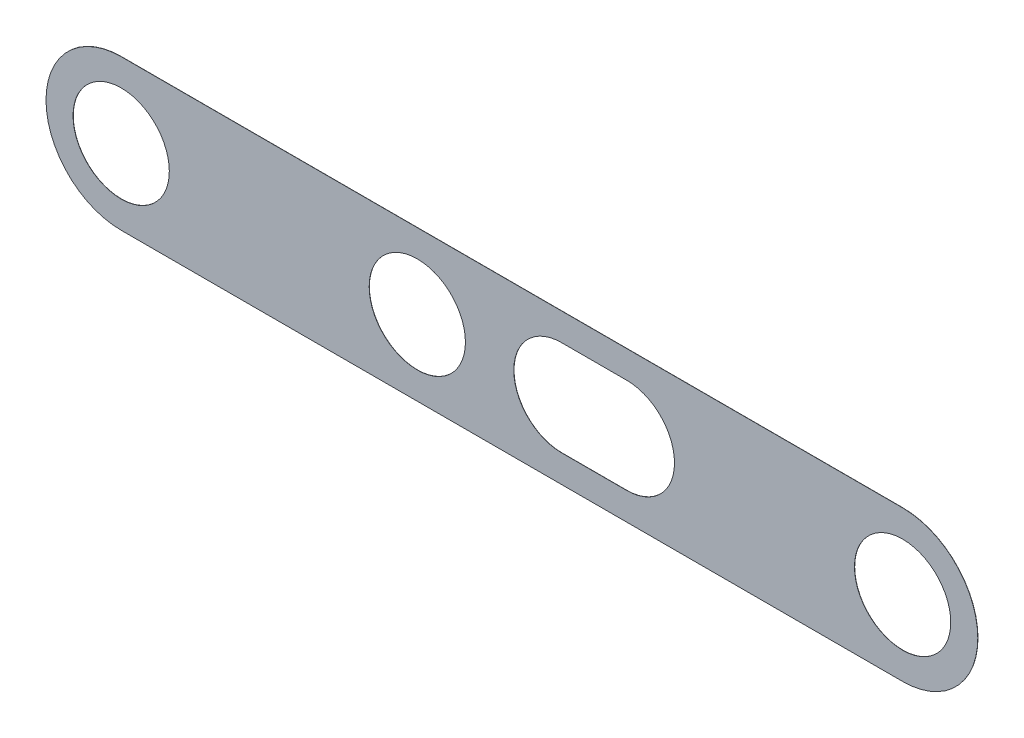
ISO-10303-21;
HEADER;
FILE_DESCRIPTION(('STEP AP214'),'2;1');
FILE_NAME('part.step','',(''),(''),'','','');
FILE_SCHEMA(('AUTOMOTIVE_DESIGN { 1 0 10303 214 1 1 1 1 }'));
ENDSEC;
DATA;
#1=APPLICATION_CONTEXT('core data for automotive mechanical design processes');
#2=APPLICATION_PROTOCOL_DEFINITION('international standard','automotive_design',2000,#1);
#3=PRODUCT_CONTEXT('',#1,'mechanical');
#4=PRODUCT('Part','Part','',(#3));
#5=PRODUCT_RELATED_PRODUCT_CATEGORY('part','',(#4));
#6=PRODUCT_DEFINITION_FORMATION('','',#4);
#7=PRODUCT_DEFINITION_CONTEXT('part definition',#1,'design');
#8=PRODUCT_DEFINITION('design','',#6,#7);
#9=PRODUCT_DEFINITION_SHAPE('','',#8);
#10=(LENGTH_UNIT() NAMED_UNIT(*) SI_UNIT(.MILLI.,.METRE.));
#11=(NAMED_UNIT(*) PLANE_ANGLE_UNIT() SI_UNIT($,.RADIAN.));
#12=(NAMED_UNIT(*) SI_UNIT($,.STERADIAN.) SOLID_ANGLE_UNIT());
#13=UNCERTAINTY_MEASURE_WITH_UNIT(LENGTH_MEASURE(1.E-05),#10,'distance_accuracy_value','');
#14=(GEOMETRIC_REPRESENTATION_CONTEXT(3) GLOBAL_UNCERTAINTY_ASSIGNED_CONTEXT((#13)) GLOBAL_UNIT_ASSIGNED_CONTEXT((#10,
#11,#12)) REPRESENTATION_CONTEXT('',''));
#15=CARTESIAN_POINT('',(0.,0.,0.));
#16=DIRECTION('',(0.,0.,1.));
#17=DIRECTION('',(1.,0.,0.));
#18=AXIS2_PLACEMENT_3D('',#15,#16,#17);
#19=CARTESIAN_POINT('',(-47.5,0.,-0.65));
#20=DIRECTION('',(0.,0.,1.));
#21=DIRECTION('',(1.,0.,0.));
#22=AXIS2_PLACEMENT_3D('',#19,#20,#21);
#23=CYLINDRICAL_SURFACE('',#22,5.85);
#24=DIRECTION('',(0.,0.,1.));
#25=VECTOR('',#24,1.);
#26=CARTESIAN_POINT('',(-53.35,0.,-0.675));
#27=LINE('',#26,#25);
#28=CARTESIAN_POINT('',(-53.35,0.,-0.675));
#29=VERTEX_POINT('',#28);
#30=CARTESIAN_POINT('',(-53.35,0.,-0.65));
#31=VERTEX_POINT('',#30);
#32=EDGE_CURVE('E11',#29,#31,#27,.T.);
#33=ORIENTED_EDGE('',*,*,#32,.F.);
#34=CARTESIAN_POINT('',(-47.5,0.,-0.675));
#35=DIRECTION('',(0.,0.,-1.));
#36=DIRECTION('',(-1.,0.,0.));
#37=AXIS2_PLACEMENT_3D('',#34,#35,#36);
#38=CIRCLE('',#37,5.85);
#39=CARTESIAN_POINT('',(-41.65,0.,-0.675));
#40=VERTEX_POINT('',#39);
#41=EDGE_CURVE('E245',#29,#40,#38,.T.);
#42=ORIENTED_EDGE('',*,*,#41,.T.);
#43=DIRECTION('',(0.,0.,1.));
#44=VECTOR('',#43,1.);
#45=CARTESIAN_POINT('',(-41.65,0.,-0.675));
#46=LINE('',#45,#44);
#47=CARTESIAN_POINT('',(-41.65,0.,-0.65));
#48=VERTEX_POINT('',#47);
#49=EDGE_CURVE('E28',#40,#48,#46,.T.);
#50=ORIENTED_EDGE('',*,*,#49,.T.);
#51=CARTESIAN_POINT('',(-47.5,0.,-0.65));
#52=DIRECTION('',(0.,0.,1.));
#53=DIRECTION('',(1.,0.,0.));
#54=AXIS2_PLACEMENT_3D('',#51,#52,#53);
#55=CIRCLE('',#54,5.85);
#56=EDGE_CURVE('E282',#48,#31,#55,.T.);
#57=ORIENTED_EDGE('',*,*,#56,.T.);
#58=EDGE_LOOP('',(#33,#42,#50,#57));
#59=FACE_BOUND('',#58,.T.);
#60=ADVANCED_FACE('F17',(#59),#23,.F.);
#61=CARTESIAN_POINT('',(-47.5,0.,-0.65));
#62=DIRECTION('',(0.,0.,1.));
#63=DIRECTION('',(1.,0.,0.));
#64=AXIS2_PLACEMENT_3D('',#61,#62,#63);
#65=CYLINDRICAL_SURFACE('',#64,5.85);
#66=ORIENTED_EDGE('',*,*,#49,.F.);
#67=CARTESIAN_POINT('',(-47.5,0.,-0.675));
#68=DIRECTION('',(0.,0.,-1.));
#69=DIRECTION('',(1.,0.,0.));
#70=AXIS2_PLACEMENT_3D('',#67,#68,#69);
#71=CIRCLE('',#70,5.85);
#72=EDGE_CURVE('E249',#40,#29,#71,.T.);
#73=ORIENTED_EDGE('',*,*,#72,.T.);
#74=ORIENTED_EDGE('',*,*,#32,.T.);
#75=CARTESIAN_POINT('',(-47.5,0.,-0.65));
#76=DIRECTION('',(0.,0.,1.));
#77=DIRECTION('',(-1.,0.,0.));
#78=AXIS2_PLACEMENT_3D('',#75,#76,#77);
#79=CIRCLE('',#78,5.85);
#80=EDGE_CURVE('E286',#31,#48,#79,.T.);
#81=ORIENTED_EDGE('',*,*,#80,.T.);
#82=EDGE_LOOP('',(#66,#73,#74,#81));
#83=FACE_BOUND('',#82,.T.);
#84=ADVANCED_FACE('F365',(#83),#65,.F.);
#85=CARTESIAN_POINT('',(13.96785551477,0.,-0.65));
#86=DIRECTION('',(0.,0.,1.));
#87=DIRECTION('',(1.,0.,0.));
#88=AXIS2_PLACEMENT_3D('',#85,#86,#87);
#89=CYLINDRICAL_SURFACE('',#88,5.8);
#90=DIRECTION('',(0.,0.,1.));
#91=VECTOR('',#90,1.);
#92=CARTESIAN_POINT('',(13.96785551477,5.8,-0.675));
#93=LINE('',#92,#91);
#94=CARTESIAN_POINT('',(13.96785551477,5.8,-0.675));
#95=VERTEX_POINT('',#94);
#96=CARTESIAN_POINT('',(13.96785551477,5.8,-0.65));
#97=VERTEX_POINT('',#96);
#98=EDGE_CURVE('E225',#95,#97,#93,.T.);
#99=ORIENTED_EDGE('',*,*,#98,.F.);
#100=CARTESIAN_POINT('',(13.96785551477,0.,-0.675));
#101=DIRECTION('',(0.,0.,-1.));
#102=DIRECTION('',(0.,1.,0.));
#103=AXIS2_PLACEMENT_3D('',#100,#101,#102);
#104=CIRCLE('',#103,5.8);
#105=CARTESIAN_POINT('',(19.76785551477,0.,-0.675));
#106=VERTEX_POINT('',#105);
#107=EDGE_CURVE('E495',#95,#106,#104,.T.);
#108=ORIENTED_EDGE('',*,*,#107,.T.);
#109=CARTESIAN_POINT('',(13.96785551477,0.,-0.675));
#110=DIRECTION('',(0.,0.,-1.));
#111=DIRECTION('',(1.,0.,0.));
#112=AXIS2_PLACEMENT_3D('',#109,#110,#111);
#113=CIRCLE('',#112,5.8);
#114=CARTESIAN_POINT('',(13.96785551477,-5.8,-0.675));
#115=VERTEX_POINT('',#114);
#116=EDGE_CURVE('E497',#106,#115,#113,.T.);
#117=ORIENTED_EDGE('',*,*,#116,.T.);
#118=DIRECTION('',(0.,0.,-1.));
#119=VECTOR('',#118,1.);
#120=CARTESIAN_POINT('',(13.96785551477,-5.8,-0.65));
#121=LINE('',#120,#119);
#122=CARTESIAN_POINT('',(13.96785551477,-5.8,-0.65));
#123=VERTEX_POINT('',#122);
#124=EDGE_CURVE('E205',#123,#115,#121,.T.);
#125=ORIENTED_EDGE('',*,*,#124,.F.);
#126=CARTESIAN_POINT('',(13.96785551477,0.,-0.65));
#127=DIRECTION('',(0.,0.,1.));
#128=DIRECTION('',(0.,-1.,0.));
#129=AXIS2_PLACEMENT_3D('',#126,#127,#128);
#130=CIRCLE('',#129,5.8);
#131=CARTESIAN_POINT('',(19.76785551477,0.,-0.65));
#132=VERTEX_POINT('',#131);
#133=EDGE_CURVE('E219',#123,#132,#130,.T.);
#134=ORIENTED_EDGE('',*,*,#133,.T.);
#135=CARTESIAN_POINT('',(13.96785551477,0.,-0.65));
#136=DIRECTION('',(0.,0.,1.));
#137=DIRECTION('',(1.,0.,0.));
#138=AXIS2_PLACEMENT_3D('',#135,#136,#137);
#139=CIRCLE('',#138,5.8);
#140=EDGE_CURVE('E221',#132,#97,#139,.T.);
#141=ORIENTED_EDGE('',*,*,#140,.T.);
#142=EDGE_LOOP('',(#99,#108,#117,#125,#134,#141));
#143=FACE_BOUND('',#142,.T.);
#144=ADVANCED_FACE('F371',(#143),#89,.F.);
#145=CARTESIAN_POINT('',(6.032144485231,5.8,-0.65));
#146=DIRECTION('',(0.,-1.,0.));
#147=DIRECTION('',(0.,0.,-1.));
#148=AXIS2_PLACEMENT_3D('',#145,#146,#147);
#149=PLANE('',#148);
#150=DIRECTION('',(0.,0.,-1.));
#151=VECTOR('',#150,1.);
#152=CARTESIAN_POINT('',(6.032144485231,5.8,-0.65));
#153=LINE('',#152,#151);
#154=CARTESIAN_POINT('',(6.032144485231,5.8,-0.65));
#155=VERTEX_POINT('',#154);
#156=CARTESIAN_POINT('',(6.032144485231,5.8,-0.675));
#157=VERTEX_POINT('',#156);
#158=EDGE_CURVE('E180',#155,#157,#153,.T.);
#159=ORIENTED_EDGE('',*,*,#158,.T.);
#160=DIRECTION('',(-1.,0.,0.));
#161=VECTOR('',#160,1.);
#162=CARTESIAN_POINT('',(13.96785551477,5.8,-0.675));
#163=LINE('',#162,#161);
#164=EDGE_CURVE('E503',#95,#157,#163,.T.);
#165=ORIENTED_EDGE('',*,*,#164,.F.);
#166=ORIENTED_EDGE('',*,*,#98,.T.);
#167=DIRECTION('',(-1.,0.,0.));
#168=VECTOR('',#167,1.);
#169=CARTESIAN_POINT('',(13.96785551477,5.8,-0.65));
#170=LINE('',#169,#168);
#171=EDGE_CURVE('E185',#97,#155,#170,.T.);
#172=ORIENTED_EDGE('',*,*,#171,.T.);
#173=EDGE_LOOP('',(#159,#165,#166,#172));
#174=FACE_BOUND('',#173,.T.);
#175=ADVANCED_FACE('F375',(#174),#149,.T.);
#176=CARTESIAN_POINT('',(6.032144485231,0.,-0.65));
#177=DIRECTION('',(0.,0.,1.));
#178=DIRECTION('',(1.,0.,0.));
#179=AXIS2_PLACEMENT_3D('',#176,#177,#178);
#180=CYLINDRICAL_SURFACE('',#179,5.8);
#181=DIRECTION('',(0.,0.,1.));
#182=VECTOR('',#181,1.);
#183=CARTESIAN_POINT('',(6.032144485231,-5.8,-0.675));
#184=LINE('',#183,#182);
#185=CARTESIAN_POINT('',(6.032144485231,-5.8,-0.675));
#186=VERTEX_POINT('',#185);
#187=CARTESIAN_POINT('',(6.032144485231,-5.8,-0.65));
#188=VERTEX_POINT('',#187);
#189=EDGE_CURVE('E251',#186,#188,#184,.T.);
#190=ORIENTED_EDGE('',*,*,#189,.F.);
#191=CARTESIAN_POINT('',(6.032144485231,0.,-0.675));
#192=DIRECTION('',(0.,0.,-1.));
#193=DIRECTION('',(0.,-1.,0.));
#194=AXIS2_PLACEMENT_3D('',#191,#192,#193);
#195=CIRCLE('',#194,5.8);
#196=CARTESIAN_POINT('',(0.232144485231,0.,-0.675));
#197=VERTEX_POINT('',#196);
#198=EDGE_CURVE('E273',#186,#197,#195,.T.);
#199=ORIENTED_EDGE('',*,*,#198,.T.);
#200=CARTESIAN_POINT('',(6.032144485231,0.,-0.675));
#201=DIRECTION('',(0.,0.,-1.));
#202=DIRECTION('',(-1.,0.,0.));
#203=AXIS2_PLACEMENT_3D('',#200,#201,#202);
#204=CIRCLE('',#203,5.8);
#205=EDGE_CURVE('E535',#197,#157,#204,.T.);
#206=ORIENTED_EDGE('',*,*,#205,.T.);
#207=ORIENTED_EDGE('',*,*,#158,.F.);
#208=CARTESIAN_POINT('',(6.032144485231,0.,-0.65));
#209=DIRECTION('',(0.,0.,1.));
#210=DIRECTION('',(0.,1.,0.));
#211=AXIS2_PLACEMENT_3D('',#208,#209,#210);
#212=CIRCLE('',#211,5.8);
#213=CARTESIAN_POINT('',(0.232144485231,0.,-0.65));
#214=VERTEX_POINT('',#213);
#215=EDGE_CURVE('E175',#155,#214,#212,.T.);
#216=ORIENTED_EDGE('',*,*,#215,.T.);
#217=CARTESIAN_POINT('',(6.032144485231,0.,-0.65));
#218=DIRECTION('',(0.,0.,1.));
#219=DIRECTION('',(-1.,0.,0.));
#220=AXIS2_PLACEMENT_3D('',#217,#218,#219);
#221=CIRCLE('',#220,5.8);
#222=EDGE_CURVE('E178',#214,#188,#221,.T.);
#223=ORIENTED_EDGE('',*,*,#222,.T.);
#224=EDGE_LOOP('',(#190,#199,#206,#207,#216,#223));
#225=FACE_BOUND('',#224,.T.);
#226=ADVANCED_FACE('F177',(#225),#180,.F.);
#227=CARTESIAN_POINT('',(13.96785551477,-5.8,-0.65));
#228=DIRECTION('',(0.,1.,0.));
#229=DIRECTION('',(1.,0.,0.));
#230=AXIS2_PLACEMENT_3D('',#227,#228,#229);
#231=PLANE('',#230);
#232=ORIENTED_EDGE('',*,*,#124,.T.);
#233=DIRECTION('',(1.,0.,0.));
#234=VECTOR('',#233,1.);
#235=CARTESIAN_POINT('',(6.032144485231,-5.8,-0.675));
#236=LINE('',#235,#234);
#237=EDGE_CURVE('E250',#186,#115,#236,.T.);
#238=ORIENTED_EDGE('',*,*,#237,.F.);
#239=ORIENTED_EDGE('',*,*,#189,.T.);
#240=DIRECTION('',(1.,0.,0.));
#241=VECTOR('',#240,1.);
#242=CARTESIAN_POINT('',(6.032144485231,-5.8,-0.65));
#243=LINE('',#242,#241);
#244=EDGE_CURVE('E192',#188,#123,#243,.T.);
#245=ORIENTED_EDGE('',*,*,#244,.T.);
#246=EDGE_LOOP('',(#232,#238,#239,#245));
#247=FACE_BOUND('',#246,.T.);
#248=ADVANCED_FACE('F383',(#247),#231,.T.);
#249=CARTESIAN_POINT('',(47.5,0.,-0.65));
#250=DIRECTION('',(0.,0.,1.));
#251=DIRECTION('',(1.,0.,0.));
#252=AXIS2_PLACEMENT_3D('',#249,#250,#251);
#253=CYLINDRICAL_SURFACE('',#252,5.85);
#254=DIRECTION('',(0.,0.,-1.));
#255=VECTOR('',#254,1.);
#256=CARTESIAN_POINT('',(53.35,0.,-0.65));
#257=LINE('',#256,#255);
#258=CARTESIAN_POINT('',(53.35,0.,-0.65));
#259=VERTEX_POINT('',#258);
#260=CARTESIAN_POINT('',(53.35,0.,-0.675));
#261=VERTEX_POINT('',#260);
#262=EDGE_CURVE('E265',#259,#261,#257,.T.);
#263=ORIENTED_EDGE('',*,*,#262,.T.);
#264=CARTESIAN_POINT('',(47.5,0.,-0.675));
#265=DIRECTION('',(0.,0.,-1.));
#266=DIRECTION('',(1.,0.,0.));
#267=AXIS2_PLACEMENT_3D('',#264,#265,#266);
#268=CIRCLE('',#267,5.85);
#269=CARTESIAN_POINT('',(41.65,0.,-0.675));
#270=VERTEX_POINT('',#269);
#271=EDGE_CURVE('E257',#261,#270,#268,.T.);
#272=ORIENTED_EDGE('',*,*,#271,.T.);
#273=DIRECTION('',(0.,0.,-1.));
#274=VECTOR('',#273,1.);
#275=CARTESIAN_POINT('',(41.65,0.,-0.65));
#276=LINE('',#275,#274);
#277=CARTESIAN_POINT('',(41.65,0.,-0.65));
#278=VERTEX_POINT('',#277);
#279=EDGE_CURVE('E262',#278,#270,#276,.T.);
#280=ORIENTED_EDGE('',*,*,#279,.F.);
#281=CARTESIAN_POINT('',(47.5,0.,-0.65));
#282=DIRECTION('',(0.,0.,1.));
#283=DIRECTION('',(-1.,0.,0.));
#284=AXIS2_PLACEMENT_3D('',#281,#282,#283);
#285=CIRCLE('',#284,5.85);
#286=EDGE_CURVE('E201',#278,#259,#285,.T.);
#287=ORIENTED_EDGE('',*,*,#286,.T.);
#288=EDGE_LOOP('',(#263,#272,#280,#287));
#289=FACE_BOUND('',#288,.T.);
#290=ADVANCED_FACE('F332',(#289),#253,.F.);
#291=CARTESIAN_POINT('',(47.5,0.,-0.65));
#292=DIRECTION('',(0.,0.,1.));
#293=DIRECTION('',(1.,0.,0.));
#294=AXIS2_PLACEMENT_3D('',#291,#292,#293);
#295=CYLINDRICAL_SURFACE('',#294,5.85);
#296=ORIENTED_EDGE('',*,*,#279,.T.);
#297=CARTESIAN_POINT('',(47.5,0.,-0.675));
#298=DIRECTION('',(0.,0.,-1.));
#299=DIRECTION('',(-1.,0.,0.));
#300=AXIS2_PLACEMENT_3D('',#297,#298,#299);
#301=CIRCLE('',#300,5.85);
#302=EDGE_CURVE('E508',#270,#261,#301,.T.);
#303=ORIENTED_EDGE('',*,*,#302,.T.);
#304=ORIENTED_EDGE('',*,*,#262,.F.);
#305=CARTESIAN_POINT('',(47.5,0.,-0.65));
#306=DIRECTION('',(0.,0.,1.));
#307=DIRECTION('',(1.,0.,0.));
#308=AXIS2_PLACEMENT_3D('',#305,#306,#307);
#309=CIRCLE('',#308,5.85);
#310=EDGE_CURVE('E194',#259,#278,#309,.T.);
#311=ORIENTED_EDGE('',*,*,#310,.T.);
#312=EDGE_LOOP('',(#296,#303,#304,#311));
#313=FACE_BOUND('',#312,.T.);
#314=ADVANCED_FACE('F339',(#313),#295,.F.);
#315=CARTESIAN_POINT('',(-11.5,0.,-0.65));
#316=DIRECTION('',(0.,0.,1.));
#317=DIRECTION('',(1.,0.,0.));
#318=AXIS2_PLACEMENT_3D('',#315,#316,#317);
#319=CYLINDRICAL_SURFACE('',#318,5.85);
#320=DIRECTION('',(0.,0.,1.));
#321=VECTOR('',#320,1.);
#322=CARTESIAN_POINT('',(-17.35,0.,-0.675));
#323=LINE('',#322,#321);
#324=CARTESIAN_POINT('',(-17.35,0.,-0.675));
#325=VERTEX_POINT('',#324);
#326=CARTESIAN_POINT('',(-17.35,0.,-0.65));
#327=VERTEX_POINT('',#326);
#328=EDGE_CURVE('E266',#325,#327,#323,.T.);
#329=ORIENTED_EDGE('',*,*,#328,.F.);
#330=CARTESIAN_POINT('',(-11.5,0.,-0.675));
#331=DIRECTION('',(0.,0.,-1.));
#332=DIRECTION('',(-1.,0.,0.));
#333=AXIS2_PLACEMENT_3D('',#330,#331,#332);
#334=CIRCLE('',#333,5.85);
#335=CARTESIAN_POINT('',(-5.65,0.,-0.675));
#336=VERTEX_POINT('',#335);
#337=EDGE_CURVE('E258',#325,#336,#334,.T.);
#338=ORIENTED_EDGE('',*,*,#337,.T.);
#339=DIRECTION('',(0.,0.,1.));
#340=VECTOR('',#339,1.);
#341=CARTESIAN_POINT('',(-5.65,0.,-0.675));
#342=LINE('',#341,#340);
#343=CARTESIAN_POINT('',(-5.65,0.,-0.65));
#344=VERTEX_POINT('',#343);
#345=EDGE_CURVE('E281',#336,#344,#342,.T.);
#346=ORIENTED_EDGE('',*,*,#345,.T.);
#347=CARTESIAN_POINT('',(-11.5,0.,-0.65));
#348=DIRECTION('',(0.,0.,1.));
#349=DIRECTION('',(1.,0.,0.));
#350=AXIS2_PLACEMENT_3D('',#347,#348,#349);
#351=CIRCLE('',#350,5.85);
#352=EDGE_CURVE('E213',#344,#327,#351,.T.);
#353=ORIENTED_EDGE('',*,*,#352,.T.);
#354=EDGE_LOOP('',(#329,#338,#346,#353));
#355=FACE_BOUND('',#354,.T.);
#356=ADVANCED_FACE('F347',(#355),#319,.F.);
#357=CARTESIAN_POINT('',(-11.5,0.,-0.65));
#358=DIRECTION('',(0.,0.,1.));
#359=DIRECTION('',(1.,0.,0.));
#360=AXIS2_PLACEMENT_3D('',#357,#358,#359);
#361=CYLINDRICAL_SURFACE('',#360,5.85);
#362=ORIENTED_EDGE('',*,*,#345,.F.);
#363=CARTESIAN_POINT('',(-11.5,0.,-0.675));
#364=DIRECTION('',(0.,0.,-1.));
#365=DIRECTION('',(1.,0.,0.));
#366=AXIS2_PLACEMENT_3D('',#363,#364,#365);
#367=CIRCLE('',#366,5.85);
#368=EDGE_CURVE('E254',#336,#325,#367,.T.);
#369=ORIENTED_EDGE('',*,*,#368,.T.);
#370=ORIENTED_EDGE('',*,*,#328,.T.);
#371=CARTESIAN_POINT('',(-11.5,0.,-0.65));
#372=DIRECTION('',(0.,0.,1.));
#373=DIRECTION('',(-1.,0.,0.));
#374=AXIS2_PLACEMENT_3D('',#371,#372,#373);
#375=CIRCLE('',#374,5.85);
#376=EDGE_CURVE('E218',#327,#344,#375,.T.);
#377=ORIENTED_EDGE('',*,*,#376,.T.);
#378=EDGE_LOOP('',(#362,#369,#370,#377));
#379=FACE_BOUND('',#378,.T.);
#380=ADVANCED_FACE('F19',(#379),#361,.F.);
#381=CARTESIAN_POINT('',(0.,0.,-0.675));
#382=DIRECTION('',(0.,0.,1.));
#383=DIRECTION('',(1.,0.,0.));
#384=AXIS2_PLACEMENT_3D('',#381,#382,#383);
#385=PLANE('',#384);
#386=ORIENTED_EDGE('',*,*,#41,.F.);
#387=ORIENTED_EDGE('',*,*,#72,.F.);
#388=EDGE_LOOP('',(#386,#387));
#389=FACE_BOUND('',#388,.T.);
#390=ORIENTED_EDGE('',*,*,#116,.F.);
#391=ORIENTED_EDGE('',*,*,#107,.F.);
#392=ORIENTED_EDGE('',*,*,#164,.T.);
#393=ORIENTED_EDGE('',*,*,#205,.F.);
#394=ORIENTED_EDGE('',*,*,#198,.F.);
#395=ORIENTED_EDGE('',*,*,#237,.T.);
#396=EDGE_LOOP('',(#390,#391,#392,#393,#394,#395));
#397=FACE_BOUND('',#396,.T.);
#398=ORIENTED_EDGE('',*,*,#271,.F.);
#399=ORIENTED_EDGE('',*,*,#302,.F.);
#400=EDGE_LOOP('',(#398,#399));
#401=FACE_BOUND('',#400,.T.);
#402=ORIENTED_EDGE('',*,*,#337,.F.);
#403=ORIENTED_EDGE('',*,*,#368,.F.);
#404=EDGE_LOOP('',(#402,#403));
#405=FACE_BOUND('',#404,.T.);
#406=DIRECTION('',(1.,0.,0.));
#407=VECTOR('',#406,1.);
#408=CARTESIAN_POINT('',(-47.5,9.14,-0.675));
#409=LINE('',#408,#407);
#410=CARTESIAN_POINT('',(-47.5,9.14,-0.675));
#411=VERTEX_POINT('',#410);
#412=CARTESIAN_POINT('',(47.5,9.14,-0.675));
#413=VERTEX_POINT('',#412);
#414=EDGE_CURVE('E21',#411,#413,#409,.T.);
#415=ORIENTED_EDGE('',*,*,#414,.T.);
#416=CARTESIAN_POINT('',(47.5,0.,-0.675));
#417=DIRECTION('',(0.,0.,1.));
#418=DIRECTION('',(1.,0.,0.));
#419=AXIS2_PLACEMENT_3D('',#416,#417,#418);
#420=CIRCLE('',#419,9.14);
#421=CARTESIAN_POINT('',(56.64,0.,-0.675));
#422=VERTEX_POINT('',#421);
#423=EDGE_CURVE('E243',#422,#413,#420,.T.);
#424=ORIENTED_EDGE('',*,*,#423,.F.);
#425=CARTESIAN_POINT('',(47.5,0.,-0.675));
#426=DIRECTION('',(0.,0.,1.));
#427=DIRECTION('',(0.,-1.,0.));
#428=AXIS2_PLACEMENT_3D('',#425,#426,#427);
#429=CIRCLE('',#428,9.14);
#430=CARTESIAN_POINT('',(47.5,-9.14,-0.675));
#431=VERTEX_POINT('',#430);
#432=EDGE_CURVE('E277',#431,#422,#429,.T.);
#433=ORIENTED_EDGE('',*,*,#432,.F.);
#434=DIRECTION('',(-1.,0.,0.));
#435=VECTOR('',#434,1.);
#436=CARTESIAN_POINT('',(47.5,-9.14,-0.675));
#437=LINE('',#436,#435);
#438=CARTESIAN_POINT('',(-47.5,-9.14,-0.675));
#439=VERTEX_POINT('',#438);
#440=EDGE_CURVE('E229',#431,#439,#437,.T.);
#441=ORIENTED_EDGE('',*,*,#440,.T.);
#442=CARTESIAN_POINT('',(-47.5,0.,-0.675));
#443=DIRECTION('',(0.,0.,1.));
#444=DIRECTION('',(-1.,0.,0.));
#445=AXIS2_PLACEMENT_3D('',#442,#443,#444);
#446=CIRCLE('',#445,9.14);
#447=CARTESIAN_POINT('',(-56.64,0.,-0.675));
#448=VERTEX_POINT('',#447);
#449=EDGE_CURVE('E154',#448,#439,#446,.T.);
#450=ORIENTED_EDGE('',*,*,#449,.F.);
#451=CARTESIAN_POINT('',(-47.5,0.,-0.675));
#452=DIRECTION('',(0.,0.,1.));
#453=DIRECTION('',(0.,1.,0.));
#454=AXIS2_PLACEMENT_3D('',#451,#452,#453);
#455=CIRCLE('',#454,9.14);
#456=EDGE_CURVE('E209',#411,#448,#455,.T.);
#457=ORIENTED_EDGE('',*,*,#456,.F.);
#458=EDGE_LOOP('',(#415,#424,#433,#441,#450,#457));
#459=FACE_BOUND('',#458,.T.);
#460=ADVANCED_FACE('F354',(#389,#397,#401,#405,#459),#385,.F.);
#461=CARTESIAN_POINT('',(47.5,9.14,-0.65));
#462=DIRECTION('',(0.,1.,0.));
#463=DIRECTION('',(1.,0.,0.));
#464=AXIS2_PLACEMENT_3D('',#461,#462,#463);
#465=PLANE('',#464);
#466=DIRECTION('',(0.,0.,-1.));
#467=VECTOR('',#466,1.);
#468=CARTESIAN_POINT('',(47.5,9.14,-0.65));
#469=LINE('',#468,#467);
#470=CARTESIAN_POINT('',(47.5,9.14,-0.65));
#471=VERTEX_POINT('',#470);
#472=EDGE_CURVE('E241',#471,#413,#469,.T.);
#473=ORIENTED_EDGE('',*,*,#472,.T.);
#474=ORIENTED_EDGE('',*,*,#414,.F.);
#475=DIRECTION('',(0.,0.,1.));
#476=VECTOR('',#475,1.);
#477=CARTESIAN_POINT('',(-47.5,9.14,-0.675));
#478=LINE('',#477,#476);
#479=CARTESIAN_POINT('',(-47.5,9.14,-0.65));
#480=VERTEX_POINT('',#479);
#481=EDGE_CURVE('E289',#411,#480,#478,.T.);
#482=ORIENTED_EDGE('',*,*,#481,.T.);
#483=DIRECTION('',(1.,0.,0.));
#484=VECTOR('',#483,1.);
#485=CARTESIAN_POINT('',(-47.5,9.14,-0.65));
#486=LINE('',#485,#484);
#487=EDGE_CURVE('E236',#480,#471,#486,.T.);
#488=ORIENTED_EDGE('',*,*,#487,.T.);
#489=EDGE_LOOP('',(#473,#474,#482,#488));
#490=FACE_BOUND('',#489,.T.);
#491=ADVANCED_FACE('F360',(#490),#465,.T.);
#492=CARTESIAN_POINT('',(47.5,0.,-0.65));
#493=DIRECTION('',(0.,0.,1.));
#494=DIRECTION('',(1.,0.,0.));
#495=AXIS2_PLACEMENT_3D('',#492,#493,#494);
#496=CYLINDRICAL_SURFACE('',#495,9.14);
#497=DIRECTION('',(0.,0.,1.));
#498=VECTOR('',#497,1.);
#499=CARTESIAN_POINT('',(47.5,-9.14,-0.675));
#500=LINE('',#499,#498);
#501=CARTESIAN_POINT('',(47.5,-9.14,-0.65));
#502=VERTEX_POINT('',#501);
#503=EDGE_CURVE('E269',#431,#502,#500,.T.);
#504=ORIENTED_EDGE('',*,*,#503,.F.);
#505=ORIENTED_EDGE('',*,*,#432,.T.);
#506=ORIENTED_EDGE('',*,*,#423,.T.);
#507=ORIENTED_EDGE('',*,*,#472,.F.);
#508=CARTESIAN_POINT('',(47.5,0.,-0.65));
#509=DIRECTION('',(0.,0.,-1.));
#510=DIRECTION('',(0.,1.,0.));
#511=AXIS2_PLACEMENT_3D('',#508,#509,#510);
#512=CIRCLE('',#511,9.14);
#513=CARTESIAN_POINT('',(56.64,0.,-0.65));
#514=VERTEX_POINT('',#513);
#515=EDGE_CURVE('E233',#471,#514,#512,.T.);
#516=ORIENTED_EDGE('',*,*,#515,.T.);
#517=CARTESIAN_POINT('',(47.5,0.,-0.65));
#518=DIRECTION('',(0.,0.,-1.));
#519=DIRECTION('',(1.,0.,0.));
#520=AXIS2_PLACEMENT_3D('',#517,#518,#519);
#521=CIRCLE('',#520,9.14);
#522=EDGE_CURVE('E237',#514,#502,#521,.T.);
#523=ORIENTED_EDGE('',*,*,#522,.T.);
#524=EDGE_LOOP('',(#504,#505,#506,#507,#516,#523));
#525=FACE_BOUND('',#524,.T.);
#526=ADVANCED_FACE('F304',(#525),#496,.T.);
#527=CARTESIAN_POINT('',(-47.5,-9.14,-0.65));
#528=DIRECTION('',(0.,-1.,0.));
#529=DIRECTION('',(0.,0.,-1.));
#530=AXIS2_PLACEMENT_3D('',#527,#528,#529);
#531=PLANE('',#530);
#532=DIRECTION('',(0.,0.,-1.));
#533=VECTOR('',#532,1.);
#534=CARTESIAN_POINT('',(-47.5,-9.14,-0.65));
#535=LINE('',#534,#533);
#536=CARTESIAN_POINT('',(-47.5,-9.14,-0.65));
#537=VERTEX_POINT('',#536);
#538=EDGE_CURVE('E208',#537,#439,#535,.T.);
#539=ORIENTED_EDGE('',*,*,#538,.T.);
#540=ORIENTED_EDGE('',*,*,#440,.F.);
#541=ORIENTED_EDGE('',*,*,#503,.T.);
#542=DIRECTION('',(-1.,0.,0.));
#543=VECTOR('',#542,1.);
#544=CARTESIAN_POINT('',(47.5,-9.14,-0.65));
#545=LINE('',#544,#543);
#546=EDGE_CURVE('E290',#502,#537,#545,.T.);
#547=ORIENTED_EDGE('',*,*,#546,.T.);
#548=EDGE_LOOP('',(#539,#540,#541,#547));
#549=FACE_BOUND('',#548,.T.);
#550=ADVANCED_FACE('F312',(#549),#531,.T.);
#551=CARTESIAN_POINT('',(-47.5,0.,-0.65));
#552=DIRECTION('',(0.,0.,1.));
#553=DIRECTION('',(1.,0.,0.));
#554=AXIS2_PLACEMENT_3D('',#551,#552,#553);
#555=CYLINDRICAL_SURFACE('',#554,9.14);
#556=ORIENTED_EDGE('',*,*,#481,.F.);
#557=ORIENTED_EDGE('',*,*,#456,.T.);
#558=ORIENTED_EDGE('',*,*,#449,.T.);
#559=ORIENTED_EDGE('',*,*,#538,.F.);
#560=CARTESIAN_POINT('',(-47.5,0.,-0.65));
#561=DIRECTION('',(0.,0.,-1.));
#562=DIRECTION('',(0.,-1.,0.));
#563=AXIS2_PLACEMENT_3D('',#560,#561,#562);
#564=CIRCLE('',#563,9.14);
#565=CARTESIAN_POINT('',(-56.64,0.,-0.65));
#566=VERTEX_POINT('',#565);
#567=EDGE_CURVE('E210',#537,#566,#564,.T.);
#568=ORIENTED_EDGE('',*,*,#567,.T.);
#569=CARTESIAN_POINT('',(-47.5,0.,-0.65));
#570=DIRECTION('',(0.,0.,-1.));
#571=DIRECTION('',(-1.,0.,0.));
#572=AXIS2_PLACEMENT_3D('',#569,#570,#571);
#573=CIRCLE('',#572,9.14);
#574=EDGE_CURVE('E214',#566,#480,#573,.T.);
#575=ORIENTED_EDGE('',*,*,#574,.T.);
#576=EDGE_LOOP('',(#556,#557,#558,#559,#568,#575));
#577=FACE_BOUND('',#576,.T.);
#578=ADVANCED_FACE('F342',(#577),#555,.T.);
#579=CARTESIAN_POINT('',(0.,0.,-0.65));
#580=DIRECTION('',(0.,0.,1.));
#581=DIRECTION('',(1.,0.,0.));
#582=AXIS2_PLACEMENT_3D('',#579,#580,#581);
#583=PLANE('',#582);
#584=ORIENTED_EDGE('',*,*,#56,.F.);
#585=ORIENTED_EDGE('',*,*,#80,.F.);
#586=EDGE_LOOP('',(#584,#585));
#587=FACE_BOUND('',#586,.T.);
#588=ORIENTED_EDGE('',*,*,#222,.F.);
#589=ORIENTED_EDGE('',*,*,#215,.F.);
#590=ORIENTED_EDGE('',*,*,#171,.F.);
#591=ORIENTED_EDGE('',*,*,#140,.F.);
#592=ORIENTED_EDGE('',*,*,#133,.F.);
#593=ORIENTED_EDGE('',*,*,#244,.F.);
#594=EDGE_LOOP('',(#588,#589,#590,#591,#592,#593));
#595=FACE_BOUND('',#594,.T.);
#596=ORIENTED_EDGE('',*,*,#286,.F.);
#597=ORIENTED_EDGE('',*,*,#310,.F.);
#598=EDGE_LOOP('',(#596,#597));
#599=FACE_BOUND('',#598,.T.);
#600=ORIENTED_EDGE('',*,*,#352,.F.);
#601=ORIENTED_EDGE('',*,*,#376,.F.);
#602=EDGE_LOOP('',(#600,#601));
#603=FACE_BOUND('',#602,.T.);
#604=ORIENTED_EDGE('',*,*,#546,.F.);
#605=ORIENTED_EDGE('',*,*,#522,.F.);
#606=ORIENTED_EDGE('',*,*,#515,.F.);
#607=ORIENTED_EDGE('',*,*,#487,.F.);
#608=ORIENTED_EDGE('',*,*,#574,.F.);
#609=ORIENTED_EDGE('',*,*,#567,.F.);
#610=EDGE_LOOP('',(#604,#605,#606,#607,#608,#609));
#611=FACE_BOUND('',#610,.T.);
#612=ADVANCED_FACE('F188',(#587,#595,#599,#603,#611),#583,.T.);
#613=CLOSED_SHELL('',(#60,#84,#144,#175,#226,#248,#290,#314,#356,#380,#460,#491,#526,#550,#578,#612));
#614=MANIFOLD_SOLID_BREP('B1',#613);
#615=ADVANCED_BREP_SHAPE_REPRESENTATION('',(#18,#614),#14);
#616=SHAPE_DEFINITION_REPRESENTATION(#9,#615);
ENDSEC;
END-ISO-10303-21;
